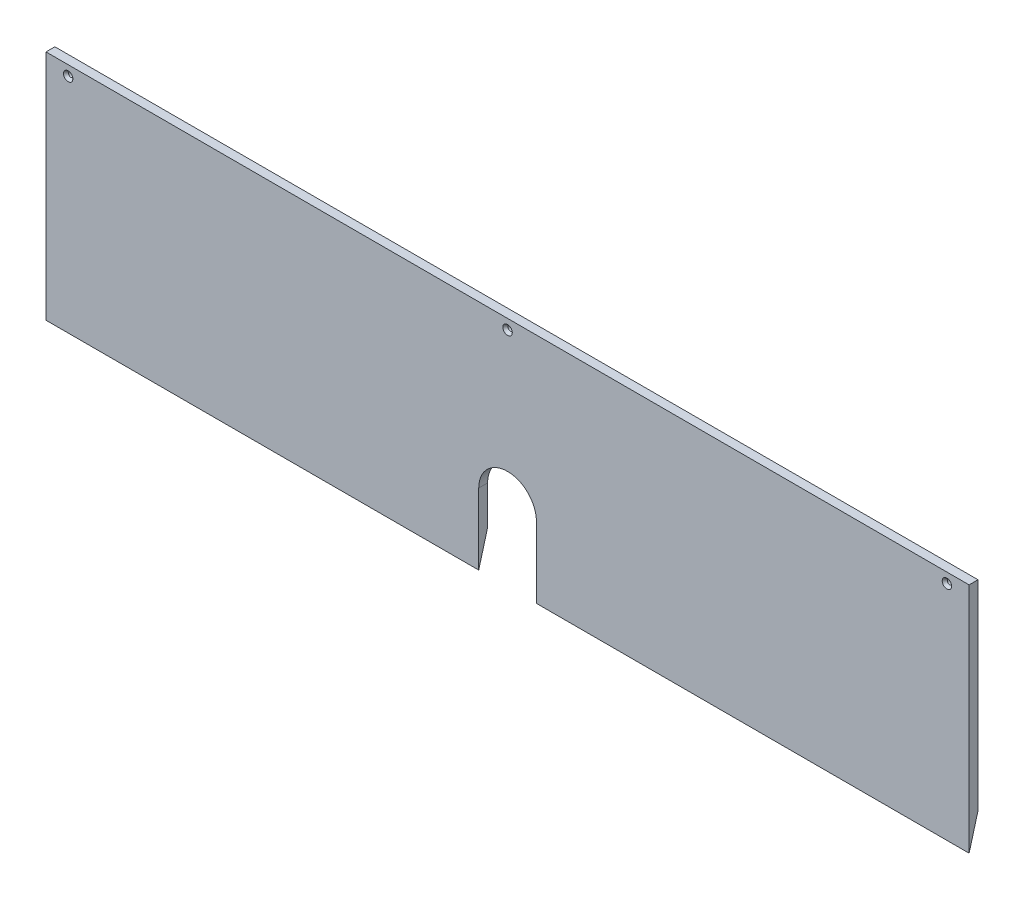
ISO-10303-21;
HEADER;
FILE_DESCRIPTION(('STEP AP214'),'2;1');
FILE_NAME('part.step','',(''),(''),'','','');
FILE_SCHEMA(('AUTOMOTIVE_DESIGN { 1 0 10303 214 1 1 1 1 }'));
ENDSEC;
DATA;
#1=APPLICATION_CONTEXT('core data for automotive mechanical design processes');
#2=APPLICATION_PROTOCOL_DEFINITION('international standard','automotive_design',2000,#1);
#3=PRODUCT_CONTEXT('',#1,'mechanical');
#4=PRODUCT('Part','Part','',(#3));
#5=PRODUCT_RELATED_PRODUCT_CATEGORY('part','',(#4));
#6=PRODUCT_DEFINITION_FORMATION('','',#4);
#7=PRODUCT_DEFINITION_CONTEXT('part definition',#1,'design');
#8=PRODUCT_DEFINITION('design','',#6,#7);
#9=PRODUCT_DEFINITION_SHAPE('','',#8);
#10=(LENGTH_UNIT() NAMED_UNIT(*) SI_UNIT(.MILLI.,.METRE.));
#11=(NAMED_UNIT(*) PLANE_ANGLE_UNIT() SI_UNIT($,.RADIAN.));
#12=(NAMED_UNIT(*) SI_UNIT($,.STERADIAN.) SOLID_ANGLE_UNIT());
#13=UNCERTAINTY_MEASURE_WITH_UNIT(LENGTH_MEASURE(1.E-05),#10,'distance_accuracy_value','');
#14=(GEOMETRIC_REPRESENTATION_CONTEXT(3) GLOBAL_UNCERTAINTY_ASSIGNED_CONTEXT((#13)) GLOBAL_UNIT_ASSIGNED_CONTEXT((#10,
#11,#12)) REPRESENTATION_CONTEXT('',''));
#15=CARTESIAN_POINT('',(0.,0.,0.));
#16=DIRECTION('',(0.,0.,1.));
#17=DIRECTION('',(1.,0.,0.));
#18=AXIS2_PLACEMENT_3D('',#15,#16,#17);
#19=CARTESIAN_POINT('',(-490.446148229026,163.66591889708,0.));
#20=DIRECTION('',(0.,0.,1.));
#21=DIRECTION('',(1.,0.,0.));
#22=AXIS2_PLACEMENT_3D('',#19,#20,#21);
#23=PLANE('',#22);
#24=CARTESIAN_POINT('',(2.197536589984E-13,315.612647404422,1.45716771982052E-13));
#25=DIRECTION('',(0.,0.,1.));
#26=DIRECTION('',(0.,-1.,0.));
#27=AXIS2_PLACEMENT_3D('',#24,#25,#26);
#28=CIRCLE('',#27,3.37819999999983);
#29=CARTESIAN_POINT('',(2.19774510269611E-13,312.234447404422,1.45904299753141E-13));
#30=VERTEX_POINT('',#29);
#31=EDGE_CURVE('E206',#30,#30,#28,.F.);
#32=ORIENTED_EDGE('',*,*,#31,.F.);
#33=EDGE_LOOP('',(#32));
#34=FACE_BOUND('',#33,.T.);
#35=CARTESIAN_POINT('',(-628.534270001134,315.612647404422,1.59594559789866E-13));
#36=DIRECTION('',(0.,0.,1.));
#37=DIRECTION('',(0.,-1.,0.));
#38=AXIS2_PLACEMENT_3D('',#35,#36,#37);
#39=CIRCLE('',#38,3.37819999999983);
#40=CARTESIAN_POINT('',(-628.534270001134,312.234447404422,1.59782087560956E-13));
#41=VERTEX_POINT('',#40);
#42=EDGE_CURVE('E200',#41,#41,#39,.F.);
#43=ORIENTED_EDGE('',*,*,#42,.F.);
#44=EDGE_LOOP('',(#43));
#45=FACE_BOUND('',#44,.T.);
#46=CARTESIAN_POINT('',(628.534270001134,315.612647404422,-3.95516952522712E-13));
#47=DIRECTION('',(0.,0.,1.));
#48=DIRECTION('',(0.,-1.,0.));
#49=AXIS2_PLACEMENT_3D('',#46,#47,#48);
#50=CIRCLE('',#49,3.37820000000005);
#51=CARTESIAN_POINT('',(628.534270001134,312.234447404422,-3.95329424751623E-13));
#52=VERTEX_POINT('',#51);
#53=EDGE_CURVE('E140',#52,#52,#50,.F.);
#54=ORIENTED_EDGE('',*,*,#53,.F.);
#55=EDGE_LOOP('',(#54));
#56=FACE_BOUND('',#55,.T.);
#57=DIRECTION('',(0.,1.,0.));
#58=VECTOR('',#57,1.);
#59=CARTESIAN_POINT('',(-41.275,163.66591889708,0.));
#60=LINE('',#59,#58);
#61=CARTESIAN_POINT('',(-41.275,43.6959761040237,0.));
#62=VERTEX_POINT('',#61);
#63=CARTESIAN_POINT('',(-41.275,99.0316903897379,0.));
#64=VERTEX_POINT('',#63);
#65=EDGE_CURVE('E270',#62,#64,#60,.T.);
#66=ORIENTED_EDGE('',*,*,#65,.F.);
#67=DIRECTION('',(1.,0.,0.));
#68=VECTOR('',#67,1.);
#69=CARTESIAN_POINT('',(-490.446148229026,43.6959761040237,0.));
#70=LINE('',#69,#68);
#71=CARTESIAN_POINT('',(-660.284270001134,43.6959761040237,0.));
#72=VERTEX_POINT('',#71);
#73=EDGE_CURVE('E148',#72,#62,#70,.T.);
#74=ORIENTED_EDGE('',*,*,#73,.F.);
#75=DIRECTION('',(0.,-1.,0.));
#76=VECTOR('',#75,1.);
#77=CARTESIAN_POINT('',(-660.284270001134,163.66591889708,0.));
#78=LINE('',#77,#76);
#79=CARTESIAN_POINT('',(-660.284270001134,329.900147404422,0.));
#80=VERTEX_POINT('',#79);
#81=EDGE_CURVE('E177',#80,#72,#78,.T.);
#82=ORIENTED_EDGE('',*,*,#81,.F.);
#83=DIRECTION('',(1.,0.,0.));
#84=VECTOR('',#83,1.);
#85=CARTESIAN_POINT('',(0.,329.900147404422,0.));
#86=LINE('',#85,#84);
#87=CARTESIAN_POINT('',(660.284270001134,329.900147404422,0.));
#88=VERTEX_POINT('',#87);
#89=EDGE_CURVE('E173',#80,#88,#86,.T.);
#90=ORIENTED_EDGE('',*,*,#89,.T.);
#91=DIRECTION('',(0.,-1.,0.));
#92=VECTOR('',#91,1.);
#93=CARTESIAN_POINT('',(660.284270001134,163.66591889708,0.));
#94=LINE('',#93,#92);
#95=CARTESIAN_POINT('',(660.284270001134,43.6959761040237,0.));
#96=VERTEX_POINT('',#95);
#97=EDGE_CURVE('E181',#88,#96,#94,.T.);
#98=ORIENTED_EDGE('',*,*,#97,.T.);
#99=CARTESIAN_POINT('',(41.275,43.6959761040237,0.));
#100=VERTEX_POINT('',#99);
#101=EDGE_CURVE('E191',#100,#96,#70,.T.);
#102=ORIENTED_EDGE('',*,*,#101,.F.);
#103=DIRECTION('',(0.,1.,0.));
#104=VECTOR('',#103,1.);
#105=CARTESIAN_POINT('',(41.275,163.66591889708,0.));
#106=LINE('',#105,#104);
#107=CARTESIAN_POINT('',(41.275,99.0316903897379,0.));
#108=VERTEX_POINT('',#107);
#109=EDGE_CURVE('E224',#100,#108,#106,.T.);
#110=ORIENTED_EDGE('',*,*,#109,.T.);
#111=CARTESIAN_POINT('',(0.,99.031690389738,-2.27248775352962E-13));
#112=DIRECTION('',(0.,0.,1.));
#113=DIRECTION('',(0.,-1.,0.));
#114=AXIS2_PLACEMENT_3D('',#111,#112,#113);
#115=CIRCLE('',#114,41.275);
#116=EDGE_CURVE('E11',#108,#64,#115,.T.);
#117=ORIENTED_EDGE('',*,*,#116,.T.);
#118=EDGE_LOOP('',(#66,#74,#82,#90,#98,#102,#110,#117));
#119=FACE_BOUND('',#118,.T.);
#120=ADVANCED_FACE('F46',(#34,#45,#56,#119),#23,.F.);
#121=CARTESIAN_POINT('',(-490.446148229026,163.66591889708,12.7));
#122=DIRECTION('',(0.,0.,1.));
#123=DIRECTION('',(1.,0.,0.));
#124=AXIS2_PLACEMENT_3D('',#121,#122,#123);
#125=PLANE('',#124);
#126=CARTESIAN_POINT('',(2.20106154808718E-13,315.612647404422,12.6999999999998));
#127=DIRECTION('',(0.,0.,1.));
#128=DIRECTION('',(0.,-1.,0.));
#129=AXIS2_PLACEMENT_3D('',#126,#127,#128);
#130=CIRCLE('',#129,6.74370000000013);
#131=CARTESIAN_POINT('',(2.20147778962902E-13,308.868947404421,12.6999999999998));
#132=VERTEX_POINT('',#131);
#133=EDGE_CURVE('E294',#132,#132,#130,.T.);
#134=ORIENTED_EDGE('',*,*,#133,.F.);
#135=EDGE_LOOP('',(#134));
#136=FACE_BOUND('',#135,.T.);
#137=CARTESIAN_POINT('',(-628.534270001134,315.612647404422,12.6999999999998));
#138=DIRECTION('',(0.,0.,1.));
#139=DIRECTION('',(0.,-1.,0.));
#140=AXIS2_PLACEMENT_3D('',#137,#138,#139);
#141=CIRCLE('',#140,6.74370000000013);
#142=CARTESIAN_POINT('',(-628.534270001134,308.868947404421,12.6999999999998));
#143=VERTEX_POINT('',#142);
#144=EDGE_CURVE('E210',#143,#143,#141,.T.);
#145=ORIENTED_EDGE('',*,*,#144,.F.);
#146=EDGE_LOOP('',(#145));
#147=FACE_BOUND('',#146,.T.);
#148=CARTESIAN_POINT('',(628.534270001134,315.612647404422,12.7000000000006));
#149=DIRECTION('',(0.,0.,1.));
#150=DIRECTION('',(0.,-1.,0.));
#151=AXIS2_PLACEMENT_3D('',#148,#149,#150);
#152=CIRCLE('',#151,6.7437);
#153=CARTESIAN_POINT('',(628.534270001134,308.868947404422,12.7000000000006));
#154=VERTEX_POINT('',#153);
#155=EDGE_CURVE('E204',#154,#154,#152,.T.);
#156=ORIENTED_EDGE('',*,*,#155,.F.);
#157=EDGE_LOOP('',(#156));
#158=FACE_BOUND('',#157,.T.);
#159=DIRECTION('',(1.,0.,0.));
#160=VECTOR('',#159,1.);
#161=CARTESIAN_POINT('',(0.,-2.56830961026197,12.7000000000001));
#162=LINE('',#161,#160);
#163=CARTESIAN_POINT('',(-660.284270001134,-2.56830961026203,12.7000000000001));
#164=VERTEX_POINT('',#163);
#165=CARTESIAN_POINT('',(-41.275,-2.56830961026197,12.7000000000001));
#166=VERTEX_POINT('',#165);
#167=EDGE_CURVE('E145',#164,#166,#162,.T.);
#168=ORIENTED_EDGE('',*,*,#167,.T.);
#169=DIRECTION('',(0.,1.,0.));
#170=VECTOR('',#169,1.);
#171=CARTESIAN_POINT('',(-41.275,27.1790833719824,12.7));
#172=LINE('',#171,#170);
#173=CARTESIAN_POINT('',(-41.275,99.031690389738,12.7));
#174=VERTEX_POINT('',#173);
#175=EDGE_CURVE('E131',#166,#174,#172,.T.);
#176=ORIENTED_EDGE('',*,*,#175,.T.);
#177=CARTESIAN_POINT('',(0.,99.0316903897381,12.6999999999997));
#178=DIRECTION('',(0.,0.,1.));
#179=DIRECTION('',(0.,-1.,0.));
#180=AXIS2_PLACEMENT_3D('',#177,#178,#179);
#181=CIRCLE('',#180,41.275);
#182=CARTESIAN_POINT('',(41.275,99.0316903897381,12.7));
#183=VERTEX_POINT('',#182);
#184=EDGE_CURVE('E55',#174,#183,#181,.F.);
#185=ORIENTED_EDGE('',*,*,#184,.T.);
#186=DIRECTION('',(0.,1.,0.));
#187=VECTOR('',#186,1.);
#188=CARTESIAN_POINT('',(41.275,27.1790833719824,12.7));
#189=LINE('',#188,#187);
#190=CARTESIAN_POINT('',(41.275,-2.56830961026197,12.7000000000001));
#191=VERTEX_POINT('',#190);
#192=EDGE_CURVE('E139',#191,#183,#189,.T.);
#193=ORIENTED_EDGE('',*,*,#192,.F.);
#194=CARTESIAN_POINT('',(660.284270001134,-2.56830961026202,12.7));
#195=VERTEX_POINT('',#194);
#196=EDGE_CURVE('E160',#191,#195,#162,.T.);
#197=ORIENTED_EDGE('',*,*,#196,.T.);
#198=DIRECTION('',(0.,-1.,0.));
#199=VECTOR('',#198,1.);
#200=CARTESIAN_POINT('',(660.284270001134,163.66591889708,12.6999999999999));
#201=LINE('',#200,#199);
#202=CARTESIAN_POINT('',(660.284270001134,329.900147404422,12.7));
#203=VERTEX_POINT('',#202);
#204=EDGE_CURVE('E159',#203,#195,#201,.T.);
#205=ORIENTED_EDGE('',*,*,#204,.F.);
#206=DIRECTION('',(1.,0.,0.));
#207=VECTOR('',#206,1.);
#208=CARTESIAN_POINT('',(0.,329.900147404422,12.7));
#209=LINE('',#208,#207);
#210=CARTESIAN_POINT('',(-660.284270001134,329.900147404422,12.7));
#211=VERTEX_POINT('',#210);
#212=EDGE_CURVE('E185',#211,#203,#209,.T.);
#213=ORIENTED_EDGE('',*,*,#212,.F.);
#214=DIRECTION('',(0.,-1.,0.));
#215=VECTOR('',#214,1.);
#216=CARTESIAN_POINT('',(-660.284270001134,163.66591889708,12.7));
#217=LINE('',#216,#215);
#218=EDGE_CURVE('E157',#211,#164,#217,.T.);
#219=ORIENTED_EDGE('',*,*,#218,.T.);
#220=EDGE_LOOP('',(#168,#176,#185,#193,#197,#205,#213,#219));
#221=FACE_BOUND('',#220,.T.);
#222=ADVANCED_FACE('F154',(#136,#147,#158,#221),#125,.T.);
#223=CARTESIAN_POINT('',(2.12949277293204E-13,658.766562631298,-168.842906105526));
#224=DIRECTION('',(0.,-0.26471698178117,-0.964326147917118));
#225=DIRECTION('',(1.,0.,0.));
#226=AXIS2_PLACEMENT_3D('',#223,#224,#225);
#227=PLANE('',#226);
#228=ORIENTED_EDGE('',*,*,#73,.T.);
#229=DIRECTION('',(0.,-0.964326147917118,0.26471698178117));
#230=VECTOR('',#229,1.);
#231=CARTESIAN_POINT('',(-41.275,658.766562631298,-168.842906105526));
#232=LINE('',#231,#230);
#233=EDGE_CURVE('E134',#62,#166,#232,.T.);
#234=ORIENTED_EDGE('',*,*,#233,.T.);
#235=ORIENTED_EDGE('',*,*,#167,.F.);
#236=DIRECTION('',(0.,0.964326147917118,-0.26471698178117));
#237=VECTOR('',#236,1.);
#238=CARTESIAN_POINT('',(-660.284270001134,152.017041961993,-29.7351945492464));
#239=LINE('',#238,#237);
#240=EDGE_CURVE('E178',#164,#72,#239,.T.);
#241=ORIENTED_EDGE('',*,*,#240,.T.);
#242=EDGE_LOOP('',(#228,#234,#235,#241));
#243=FACE_BOUND('',#242,.T.);
#244=ADVANCED_FACE('F144',(#243),#227,.T.);
#245=CARTESIAN_POINT('',(-660.284270001134,163.66591889708,12.7));
#246=DIRECTION('',(1.,0.,0.));
#247=DIRECTION('',(0.,-0.26471698178117,-0.964326147917118));
#248=AXIS2_PLACEMENT_3D('',#245,#246,#247);
#249=PLANE('',#248);
#250=ORIENTED_EDGE('',*,*,#240,.F.);
#251=ORIENTED_EDGE('',*,*,#218,.F.);
#252=DIRECTION('',(0.,0.,-1.));
#253=VECTOR('',#252,1.);
#254=CARTESIAN_POINT('',(-660.284270001134,329.900147404422,12.7));
#255=LINE('',#254,#253);
#256=EDGE_CURVE('E188',#211,#80,#255,.T.);
#257=ORIENTED_EDGE('',*,*,#256,.T.);
#258=ORIENTED_EDGE('',*,*,#81,.T.);
#259=EDGE_LOOP('',(#250,#251,#257,#258));
#260=FACE_BOUND('',#259,.T.);
#261=ADVANCED_FACE('F250',(#260),#249,.F.);
#262=CARTESIAN_POINT('',(660.284270001134,163.66591889708,12.6999999999999));
#263=DIRECTION('',(1.,0.,0.));
#264=DIRECTION('',(0.,-0.26471698178117,-0.964326147917118));
#265=AXIS2_PLACEMENT_3D('',#262,#263,#264);
#266=PLANE('',#265);
#267=ORIENTED_EDGE('',*,*,#204,.T.);
#268=DIRECTION('',(0.,0.964326147917118,-0.26471698178117));
#269=VECTOR('',#268,1.);
#270=CARTESIAN_POINT('',(660.284270001134,152.017041961993,-29.7351945492464));
#271=LINE('',#270,#269);
#272=EDGE_CURVE('E268',#195,#96,#271,.T.);
#273=ORIENTED_EDGE('',*,*,#272,.T.);
#274=ORIENTED_EDGE('',*,*,#97,.F.);
#275=DIRECTION('',(0.,0.,-1.));
#276=VECTOR('',#275,1.);
#277=CARTESIAN_POINT('',(660.284270001134,329.900147404422,12.7));
#278=LINE('',#277,#276);
#279=EDGE_CURVE('E167',#203,#88,#278,.T.);
#280=ORIENTED_EDGE('',*,*,#279,.F.);
#281=EDGE_LOOP('',(#267,#273,#274,#280));
#282=FACE_BOUND('',#281,.T.);
#283=ADVANCED_FACE('F246',(#282),#266,.T.);
#284=CARTESIAN_POINT('',(0.,329.900147404422,12.7));
#285=DIRECTION('',(0.,1.,0.));
#286=DIRECTION('',(0.,0.,1.));
#287=AXIS2_PLACEMENT_3D('',#284,#285,#286);
#288=PLANE('',#287);
#289=ORIENTED_EDGE('',*,*,#89,.F.);
#290=ORIENTED_EDGE('',*,*,#256,.F.);
#291=ORIENTED_EDGE('',*,*,#212,.T.);
#292=ORIENTED_EDGE('',*,*,#279,.T.);
#293=EDGE_LOOP('',(#289,#290,#291,#292));
#294=FACE_BOUND('',#293,.T.);
#295=ADVANCED_FACE('F249',(#294),#288,.T.);
#296=DIRECTION('',(0.,-0.964326147917118,0.26471698178117));
#297=VECTOR('',#296,1.);
#298=CARTESIAN_POINT('',(41.275,658.766562631298,-168.842906105526));
#299=LINE('',#298,#297);
#300=EDGE_CURVE('E151',#100,#191,#299,.T.);
#301=ORIENTED_EDGE('',*,*,#300,.F.);
#302=ORIENTED_EDGE('',*,*,#101,.T.);
#303=ORIENTED_EDGE('',*,*,#272,.F.);
#304=ORIENTED_EDGE('',*,*,#196,.F.);
#305=EDGE_LOOP('',(#301,#302,#303,#304));
#306=FACE_BOUND('',#305,.T.);
#307=ADVANCED_FACE('F255',(#306),#227,.T.);
#308=CARTESIAN_POINT('',(-41.2750000000001,27.179083371981,-3552.23415908109));
#309=DIRECTION('',(1.,0.,0.));
#310=DIRECTION('',(0.,0.964326147917118,-0.26471698178117));
#311=AXIS2_PLACEMENT_3D('',#308,#309,#310);
#312=PLANE('',#311);
#313=ORIENTED_EDGE('',*,*,#65,.T.);
#314=DIRECTION('',(0.,0.,1.));
#315=VECTOR('',#314,1.);
#316=CARTESIAN_POINT('',(-41.2750000000001,99.0316903897353,-3552.23415908109));
#317=LINE('',#316,#315);
#318=EDGE_CURVE('E135',#64,#174,#317,.T.);
#319=ORIENTED_EDGE('',*,*,#318,.T.);
#320=ORIENTED_EDGE('',*,*,#175,.F.);
#321=ORIENTED_EDGE('',*,*,#233,.F.);
#322=EDGE_LOOP('',(#313,#319,#320,#321));
#323=FACE_BOUND('',#322,.T.);
#324=ADVANCED_FACE('F133',(#323),#312,.T.);
#325=CARTESIAN_POINT('',(41.2749999999999,27.179083371981,-3552.23415908109));
#326=DIRECTION('',(1.,0.,0.));
#327=DIRECTION('',(0.,0.964326147917118,-0.26471698178117));
#328=AXIS2_PLACEMENT_3D('',#325,#326,#327);
#329=PLANE('',#328);
#330=ORIENTED_EDGE('',*,*,#192,.T.);
#331=DIRECTION('',(0.,0.,1.));
#332=VECTOR('',#331,1.);
#333=CARTESIAN_POINT('',(41.275,99.0316903897379,1.64798730217797E-12));
#334=LINE('',#333,#332);
#335=EDGE_CURVE('E150',#183,#108,#334,.F.);
#336=ORIENTED_EDGE('',*,*,#335,.T.);
#337=ORIENTED_EDGE('',*,*,#109,.F.);
#338=ORIENTED_EDGE('',*,*,#300,.T.);
#339=EDGE_LOOP('',(#330,#336,#337,#338));
#340=FACE_BOUND('',#339,.T.);
#341=ADVANCED_FACE('F221',(#340),#329,.F.);
#342=CARTESIAN_POINT('',(628.534270001134,315.612647404419,-3553.21699062703));
#343=DIRECTION('',(0.,0.,1.));
#344=DIRECTION('',(0.,-1.,0.));
#345=AXIS2_PLACEMENT_3D('',#342,#343,#344);
#346=CYLINDRICAL_SURFACE('',#345,3.37820000000005);
#347=CARTESIAN_POINT('',(628.534270001134,315.612647404422,8.82843512549793));
#348=DIRECTION('',(0.,0.,1.));
#349=DIRECTION('',(0.,-1.,0.));
#350=AXIS2_PLACEMENT_3D('',#347,#348,#349);
#351=CIRCLE('',#350,3.37820000000011);
#352=CARTESIAN_POINT('',(628.534270001134,312.234447404422,8.82843512549793));
#353=VERTEX_POINT('',#352);
#354=EDGE_CURVE('E199',#353,#353,#351,.T.);
#355=ORIENTED_EDGE('',*,*,#354,.T.);
#356=EDGE_LOOP('',(#355));
#357=FACE_BOUND('',#356,.T.);
#358=ORIENTED_EDGE('',*,*,#53,.T.);
#359=EDGE_LOOP('',(#358));
#360=FACE_BOUND('',#359,.T.);
#361=ADVANCED_FACE('F409',(#357,#360),#346,.F.);
#362=CARTESIAN_POINT('',(628.534270001134,315.612647404422,8.82843512549793));
#363=DIRECTION('',(0.,0.,1.));
#364=DIRECTION('',(0.,-1.,0.));
#365=AXIS2_PLACEMENT_3D('',#362,#363,#364);
#366=CONICAL_SURFACE('',#365,3.3782,0.715584993317632);
#367=ORIENTED_EDGE('',*,*,#155,.T.);
#368=EDGE_LOOP('',(#367));
#369=FACE_BOUND('',#368,.T.);
#370=ORIENTED_EDGE('',*,*,#354,.F.);
#371=EDGE_LOOP('',(#370));
#372=FACE_BOUND('',#371,.T.);
#373=ADVANCED_FACE('F385',(#369,#372),#366,.F.);
#374=CARTESIAN_POINT('',(-628.534270001134,315.612647404419,-3553.21699062703));
#375=DIRECTION('',(0.,0.,1.));
#376=DIRECTION('',(0.,-1.,0.));
#377=AXIS2_PLACEMENT_3D('',#374,#375,#376);
#378=CYLINDRICAL_SURFACE('',#377,3.37819999999983);
#379=CARTESIAN_POINT('',(-628.534270001134,315.612647404422,8.82843512549709));
#380=DIRECTION('',(0.,0.,1.));
#381=DIRECTION('',(0.,-1.,0.));
#382=AXIS2_PLACEMENT_3D('',#379,#380,#381);
#383=CIRCLE('',#382,3.37820000000011);
#384=CARTESIAN_POINT('',(-628.534270001134,312.234447404422,8.82843512549709));
#385=VERTEX_POINT('',#384);
#386=EDGE_CURVE('E205',#385,#385,#383,.T.);
#387=ORIENTED_EDGE('',*,*,#386,.T.);
#388=EDGE_LOOP('',(#387));
#389=FACE_BOUND('',#388,.T.);
#390=ORIENTED_EDGE('',*,*,#42,.T.);
#391=EDGE_LOOP('',(#390));
#392=FACE_BOUND('',#391,.T.);
#393=ADVANCED_FACE('F375',(#389,#392),#378,.F.);
#394=CARTESIAN_POINT('',(-628.534270001134,315.612647404422,8.82843512549709));
#395=DIRECTION('',(0.,0.,1.));
#396=DIRECTION('',(0.,-1.,0.));
#397=AXIS2_PLACEMENT_3D('',#394,#395,#396);
#398=CONICAL_SURFACE('',#397,3.37820000000004,0.715584993317651);
#399=ORIENTED_EDGE('',*,*,#144,.T.);
#400=EDGE_LOOP('',(#399));
#401=FACE_BOUND('',#400,.T.);
#402=ORIENTED_EDGE('',*,*,#386,.F.);
#403=EDGE_LOOP('',(#402));
#404=FACE_BOUND('',#403,.T.);
#405=ADVANCED_FACE('F370',(#401,#404),#398,.F.);
#406=CARTESIAN_POINT('',(1.21132076136314E-13,315.612647404419,-3553.21699062703));
#407=DIRECTION('',(0.,0.,1.));
#408=DIRECTION('',(0.,-1.,0.));
#409=AXIS2_PLACEMENT_3D('',#406,#407,#408);
#410=CYLINDRICAL_SURFACE('',#409,3.37819999999983);
#411=CARTESIAN_POINT('',(2.19998697297093E-13,315.612647404422,8.82843512549707));
#412=DIRECTION('',(0.,0.,1.));
#413=DIRECTION('',(0.,-1.,0.));
#414=AXIS2_PLACEMENT_3D('',#411,#412,#413);
#415=CIRCLE('',#414,3.37820000000011);
#416=CARTESIAN_POINT('',(2.20019548568304E-13,312.234447404422,8.82843512549707));
#417=VERTEX_POINT('',#416);
#418=EDGE_CURVE('E211',#417,#417,#415,.T.);
#419=ORIENTED_EDGE('',*,*,#418,.T.);
#420=EDGE_LOOP('',(#419));
#421=FACE_BOUND('',#420,.T.);
#422=ORIENTED_EDGE('',*,*,#31,.T.);
#423=EDGE_LOOP('',(#422));
#424=FACE_BOUND('',#423,.T.);
#425=ADVANCED_FACE('F231',(#421,#424),#410,.F.);
#426=CARTESIAN_POINT('',(2.19998697297093E-13,315.612647404422,8.82843512549707));
#427=DIRECTION('',(0.,0.,1.));
#428=DIRECTION('',(0.,-1.,0.));
#429=AXIS2_PLACEMENT_3D('',#426,#427,#428);
#430=CONICAL_SURFACE('',#429,3.37820000000004,0.715584993317651);
#431=ORIENTED_EDGE('',*,*,#133,.T.);
#432=EDGE_LOOP('',(#431));
#433=FACE_BOUND('',#432,.T.);
#434=ORIENTED_EDGE('',*,*,#418,.F.);
#435=EDGE_LOOP('',(#434));
#436=FACE_BOUND('',#435,.T.);
#437=ADVANCED_FACE('F227',(#433,#436),#430,.F.);
#438=CARTESIAN_POINT('',(0.,99.0316903897373,-3552.23415908109));
#439=DIRECTION('',(0.,0.,1.));
#440=DIRECTION('',(0.,-1.,0.));
#441=AXIS2_PLACEMENT_3D('',#438,#439,#440);
#442=CYLINDRICAL_SURFACE('',#441,41.275);
#443=ORIENTED_EDGE('',*,*,#318,.F.);
#444=ORIENTED_EDGE('',*,*,#116,.F.);
#445=ORIENTED_EDGE('',*,*,#335,.F.);
#446=ORIENTED_EDGE('',*,*,#184,.F.);
#447=EDGE_LOOP('',(#443,#444,#445,#446));
#448=FACE_BOUND('',#447,.T.);
#449=ADVANCED_FACE('F48',(#448),#442,.F.);
#450=CLOSED_SHELL('',(#120,#222,#244,#261,#283,#295,#307,#324,#341,#361,#373,#393,#405,#425,
#437,#449));
#451=MANIFOLD_SOLID_BREP('B2',#450);
#452=ADVANCED_BREP_SHAPE_REPRESENTATION('',(#18,#451),#14);
#453=SHAPE_DEFINITION_REPRESENTATION(#9,#452);
ENDSEC;
END-ISO-10303-21;
